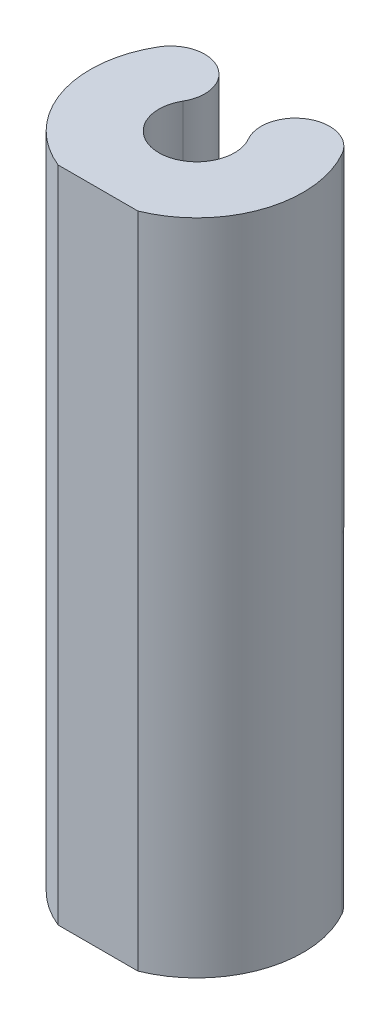
ISO-10303-21;
HEADER;
FILE_DESCRIPTION(('STEP AP214'),'2;1');
FILE_NAME('part.step','',(''),(''),'','','');
FILE_SCHEMA(('AUTOMOTIVE_DESIGN { 1 0 10303 214 1 1 1 1 }'));
ENDSEC;
DATA;
#1=APPLICATION_CONTEXT('core data for automotive mechanical design processes');
#2=APPLICATION_PROTOCOL_DEFINITION('international standard','automotive_design',2000,#1);
#3=PRODUCT_CONTEXT('',#1,'mechanical');
#4=PRODUCT('Part','Part','',(#3));
#5=PRODUCT_RELATED_PRODUCT_CATEGORY('part','',(#4));
#6=PRODUCT_DEFINITION_FORMATION('','',#4);
#7=PRODUCT_DEFINITION_CONTEXT('part definition',#1,'design');
#8=PRODUCT_DEFINITION('design','',#6,#7);
#9=PRODUCT_DEFINITION_SHAPE('','',#8);
#10=(LENGTH_UNIT() NAMED_UNIT(*) SI_UNIT(.MILLI.,.METRE.));
#11=(NAMED_UNIT(*) PLANE_ANGLE_UNIT() SI_UNIT($,.RADIAN.));
#12=(NAMED_UNIT(*) SI_UNIT($,.STERADIAN.) SOLID_ANGLE_UNIT());
#13=UNCERTAINTY_MEASURE_WITH_UNIT(LENGTH_MEASURE(1.E-05),#10,'distance_accuracy_value','');
#14=(GEOMETRIC_REPRESENTATION_CONTEXT(3) GLOBAL_UNCERTAINTY_ASSIGNED_CONTEXT((#13)) GLOBAL_UNIT_ASSIGNED_CONTEXT((#10,
#11,#12)) REPRESENTATION_CONTEXT('',''));
#15=CARTESIAN_POINT('',(0.,0.,0.));
#16=DIRECTION('',(0.,0.,1.));
#17=DIRECTION('',(1.,0.,0.));
#18=AXIS2_PLACEMENT_3D('',#15,#16,#17);
#19=CARTESIAN_POINT('',(0.,25.4,0.));
#20=DIRECTION('',(0.,-1.,0.));
#21=DIRECTION('',(0.,0.,-1.));
#22=AXIS2_PLACEMENT_3D('',#19,#20,#21);
#23=CYLINDRICAL_SURFACE('',#22,8.2169);
#24=DIRECTION('',(0.,1.,0.));
#25=VECTOR('',#24,1.);
#26=CARTESIAN_POINT('',(-3.07458055838516,0.,7.62));
#27=LINE('',#26,#25);
#28=CARTESIAN_POINT('',(-3.07458055838516,0.,7.62));
#29=VERTEX_POINT('',#28);
#30=CARTESIAN_POINT('',(-3.07458055838516,50.8,7.62));
#31=VERTEX_POINT('',#30);
#32=EDGE_CURVE('E108',#29,#31,#27,.T.);
#33=ORIENTED_EDGE('',*,*,#32,.T.);
#34=CARTESIAN_POINT('',(0.,50.8,0.));
#35=DIRECTION('',(0.,1.,0.));
#36=DIRECTION('',(0.,0.,1.));
#37=AXIS2_PLACEMENT_3D('',#34,#35,#36);
#38=CIRCLE('',#37,8.2169);
#39=CARTESIAN_POINT('',(-7.10918913480885,50.8,-4.12030040840663));
#40=VERTEX_POINT('',#39);
#41=EDGE_CURVE('E180',#40,#31,#38,.T.);
#42=ORIENTED_EDGE('',*,*,#41,.F.);
#43=DIRECTION('',(0.,-1.,0.));
#44=VECTOR('',#43,1.);
#45=CARTESIAN_POINT('',(-7.10918913480885,50.8,-4.12030040840663));
#46=LINE('',#45,#44);
#47=CARTESIAN_POINT('',(-7.10918913480885,25.4,-4.12030040840663));
#48=VERTEX_POINT('',#47);
#49=EDGE_CURVE('E160',#40,#48,#46,.T.);
#50=ORIENTED_EDGE('',*,*,#49,.T.);
#51=DIRECTION('',(0.,-1.,0.));
#52=VECTOR('',#51,1.);
#53=CARTESIAN_POINT('',(-7.10918913480885,25.4,-4.12030040840662));
#54=LINE('',#53,#52);
#55=CARTESIAN_POINT('',(-7.10918913480885,0.,-4.12030040840662));
#56=VERTEX_POINT('',#55);
#57=EDGE_CURVE('E127',#48,#56,#54,.T.);
#58=ORIENTED_EDGE('',*,*,#57,.T.);
#59=CARTESIAN_POINT('',(0.,0.,0.));
#60=DIRECTION('',(0.,1.,0.));
#61=DIRECTION('',(0.,0.,1.));
#62=AXIS2_PLACEMENT_3D('',#59,#60,#61);
#63=CIRCLE('',#62,8.2169);
#64=EDGE_CURVE('E122',#56,#29,#63,.T.);
#65=ORIENTED_EDGE('',*,*,#64,.T.);
#66=EDGE_LOOP('',(#33,#42,#50,#58,#65));
#67=FACE_BOUND('',#66,.T.);
#68=ADVANCED_FACE('F34',(#67),#23,.T.);
#69=DIRECTION('',(0.,1.,0.));
#70=VECTOR('',#69,1.);
#71=CARTESIAN_POINT('',(3.07458055838516,0.,7.62));
#72=LINE('',#71,#70);
#73=CARTESIAN_POINT('',(3.07458055838516,0.,7.62));
#74=VERTEX_POINT('',#73);
#75=CARTESIAN_POINT('',(3.07458055838516,50.8,7.62));
#76=VERTEX_POINT('',#75);
#77=EDGE_CURVE('E49',#74,#76,#72,.T.);
#78=ORIENTED_EDGE('',*,*,#77,.F.);
#79=CARTESIAN_POINT('',(7.10918913480885,0.,-4.12030040840662));
#80=VERTEX_POINT('',#79);
#81=EDGE_CURVE('E75',#74,#80,#63,.T.);
#82=ORIENTED_EDGE('',*,*,#81,.T.);
#83=DIRECTION('',(0.,-1.,0.));
#84=VECTOR('',#83,1.);
#85=CARTESIAN_POINT('',(7.10918913480885,25.4,-4.12030040840662));
#86=LINE('',#85,#84);
#87=CARTESIAN_POINT('',(7.10918913480885,25.4,-4.12030040840662));
#88=VERTEX_POINT('',#87);
#89=EDGE_CURVE('E58',#88,#80,#86,.T.);
#90=ORIENTED_EDGE('',*,*,#89,.F.);
#91=DIRECTION('',(0.,-1.,0.));
#92=VECTOR('',#91,1.);
#93=CARTESIAN_POINT('',(7.10918913480885,50.8,-4.12030040840662));
#94=LINE('',#93,#92);
#95=CARTESIAN_POINT('',(7.10918913480885,50.8,-4.12030040840662));
#96=VERTEX_POINT('',#95);
#97=EDGE_CURVE('E149',#96,#88,#94,.T.);
#98=ORIENTED_EDGE('',*,*,#97,.F.);
#99=EDGE_CURVE('E166',#76,#96,#38,.T.);
#100=ORIENTED_EDGE('',*,*,#99,.F.);
#101=EDGE_LOOP('',(#78,#82,#90,#98,#100));
#102=FACE_BOUND('',#101,.T.);
#103=ADVANCED_FACE('F187',(#102),#23,.T.);
#104=CARTESIAN_POINT('',(0.,0.,0.));
#105=DIRECTION('',(0.,1.,0.));
#106=DIRECTION('',(0.,0.,1.));
#107=AXIS2_PLACEMENT_3D('',#104,#105,#106);
#108=PLANE('',#107);
#109=DIRECTION('',(1.,0.,0.));
#110=VECTOR('',#109,1.);
#111=CARTESIAN_POINT('',(0.,0.,7.62));
#112=LINE('',#111,#110);
#113=EDGE_CURVE('E111',#29,#74,#112,.T.);
#114=ORIENTED_EDGE('',*,*,#113,.F.);
#115=ORIENTED_EDGE('',*,*,#64,.F.);
#116=CARTESIAN_POINT('',(-5.461,0.,-3.16505301851328));
#117=DIRECTION('',(0.,1.,0.));
#118=DIRECTION('',(0.,0.,1.));
#119=AXIS2_PLACEMENT_3D('',#116,#117,#118);
#120=CIRCLE('',#119,1.905);
#121=CARTESIAN_POINT('',(-3.81281086519115,0.,-2.20980562861993));
#122=VERTEX_POINT('',#121);
#123=EDGE_CURVE('E132',#122,#56,#120,.T.);
#124=ORIENTED_EDGE('',*,*,#123,.F.);
#125=CARTESIAN_POINT('',(0.,0.,0.));
#126=DIRECTION('',(0.,1.,0.));
#127=DIRECTION('',(0.,0.,1.));
#128=AXIS2_PLACEMENT_3D('',#125,#126,#127);
#129=CIRCLE('',#128,4.4069);
#130=CARTESIAN_POINT('',(3.81281086519115,0.,-2.20980562861993));
#131=VERTEX_POINT('',#130);
#132=EDGE_CURVE('E146',#122,#131,#129,.T.);
#133=ORIENTED_EDGE('',*,*,#132,.T.);
#134=CARTESIAN_POINT('',(5.461,0.,-3.16505301851328));
#135=DIRECTION('',(0.,1.,0.));
#136=DIRECTION('',(0.,0.,1.));
#137=AXIS2_PLACEMENT_3D('',#134,#135,#136);
#138=CIRCLE('',#137,1.905);
#139=EDGE_CURVE('E148',#131,#80,#138,.F.);
#140=ORIENTED_EDGE('',*,*,#139,.T.);
#141=ORIENTED_EDGE('',*,*,#81,.F.);
#142=EDGE_LOOP('',(#114,#115,#124,#133,#140,#141));
#143=FACE_BOUND('',#142,.T.);
#144=ADVANCED_FACE('F120',(#143),#108,.F.);
#145=CARTESIAN_POINT('',(0.,50.8,0.));
#146=DIRECTION('',(0.,1.,0.));
#147=DIRECTION('',(0.,0.,1.));
#148=AXIS2_PLACEMENT_3D('',#145,#146,#147);
#149=PLANE('',#148);
#150=ORIENTED_EDGE('',*,*,#41,.T.);
#151=DIRECTION('',(1.,0.,0.));
#152=VECTOR('',#151,1.);
#153=CARTESIAN_POINT('',(0.,50.8,7.62));
#154=LINE('',#153,#152);
#155=EDGE_CURVE('E112',#31,#76,#154,.T.);
#156=ORIENTED_EDGE('',*,*,#155,.T.);
#157=ORIENTED_EDGE('',*,*,#99,.T.);
#158=CARTESIAN_POINT('',(4.81820623742455,50.8,-2.79250653645487));
#159=DIRECTION('',(0.,1.,0.));
#160=DIRECTION('',(0.,0.,1.));
#161=AXIS2_PLACEMENT_3D('',#158,#159,#160);
#162=CIRCLE('',#161,2.64795);
#163=CARTESIAN_POINT('',(2.52722334004024,50.8,-1.46471266450313));
#164=VERTEX_POINT('',#163);
#165=EDGE_CURVE('E177',#164,#96,#162,.F.);
#166=ORIENTED_EDGE('',*,*,#165,.F.);
#167=CARTESIAN_POINT('',(0.,50.8,0.));
#168=DIRECTION('',(0.,1.,0.));
#169=DIRECTION('',(0.,0.,1.));
#170=AXIS2_PLACEMENT_3D('',#167,#168,#169);
#171=CIRCLE('',#170,2.921);
#172=CARTESIAN_POINT('',(-2.52722334004024,50.8,-1.46471266450313));
#173=VERTEX_POINT('',#172);
#174=EDGE_CURVE('E174',#173,#164,#171,.T.);
#175=ORIENTED_EDGE('',*,*,#174,.F.);
#176=CARTESIAN_POINT('',(-4.81820623742455,50.8,-2.79250653645487));
#177=DIRECTION('',(0.,1.,0.));
#178=DIRECTION('',(0.,0.,1.));
#179=AXIS2_PLACEMENT_3D('',#176,#177,#178);
#180=CIRCLE('',#179,2.64795);
#181=EDGE_CURVE('E162',#173,#40,#180,.T.);
#182=ORIENTED_EDGE('',*,*,#181,.T.);
#183=EDGE_LOOP('',(#150,#156,#157,#166,#175,#182));
#184=FACE_BOUND('',#183,.T.);
#185=ADVANCED_FACE('F185',(#184),#149,.T.);
#186=CARTESIAN_POINT('',(5.461,25.4,-3.16505301851328));
#187=DIRECTION('',(0.,-1.,0.));
#188=DIRECTION('',(0.,0.,-1.));
#189=AXIS2_PLACEMENT_3D('',#186,#187,#188);
#190=CYLINDRICAL_SURFACE('',#189,1.905);
#191=ORIENTED_EDGE('',*,*,#139,.F.);
#192=DIRECTION('',(0.,-1.,0.));
#193=VECTOR('',#192,1.);
#194=CARTESIAN_POINT('',(3.81281086519115,25.4,-2.20980562861993));
#195=LINE('',#194,#193);
#196=CARTESIAN_POINT('',(3.81281086519115,25.4,-2.20980562861993));
#197=VERTEX_POINT('',#196);
#198=EDGE_CURVE('E11',#197,#131,#195,.T.);
#199=ORIENTED_EDGE('',*,*,#198,.F.);
#200=CARTESIAN_POINT('',(5.461,25.4,-3.16505301851328));
#201=DIRECTION('',(0.,1.,0.));
#202=DIRECTION('',(0.,0.,1.));
#203=AXIS2_PLACEMENT_3D('',#200,#201,#202);
#204=CIRCLE('',#203,1.905);
#205=EDGE_CURVE('E128',#197,#88,#204,.F.);
#206=ORIENTED_EDGE('',*,*,#205,.T.);
#207=ORIENTED_EDGE('',*,*,#89,.T.);
#208=EDGE_LOOP('',(#191,#199,#206,#207));
#209=FACE_BOUND('',#208,.T.);
#210=ADVANCED_FACE('F36',(#209),#190,.T.);
#211=CARTESIAN_POINT('',(0.,25.4,0.));
#212=DIRECTION('',(0.,-1.,0.));
#213=DIRECTION('',(0.,0.,-1.));
#214=AXIS2_PLACEMENT_3D('',#211,#212,#213);
#215=CYLINDRICAL_SURFACE('',#214,4.4069);
#216=ORIENTED_EDGE('',*,*,#132,.F.);
#217=DIRECTION('',(0.,-1.,0.));
#218=VECTOR('',#217,1.);
#219=CARTESIAN_POINT('',(-3.81281086519115,25.4,-2.20980562861993));
#220=LINE('',#219,#218);
#221=CARTESIAN_POINT('',(-3.81281086519115,25.4,-2.20980562861993));
#222=VERTEX_POINT('',#221);
#223=EDGE_CURVE('E42',#222,#122,#220,.T.);
#224=ORIENTED_EDGE('',*,*,#223,.F.);
#225=CARTESIAN_POINT('',(0.,25.4,0.));
#226=DIRECTION('',(0.,1.,0.));
#227=DIRECTION('',(0.,0.,1.));
#228=AXIS2_PLACEMENT_3D('',#225,#226,#227);
#229=CIRCLE('',#228,4.4069);
#230=EDGE_CURVE('E130',#222,#197,#229,.T.);
#231=ORIENTED_EDGE('',*,*,#230,.T.);
#232=ORIENTED_EDGE('',*,*,#198,.T.);
#233=EDGE_LOOP('',(#216,#224,#231,#232));
#234=FACE_BOUND('',#233,.T.);
#235=ADVANCED_FACE('F147',(#234),#215,.F.);
#236=CARTESIAN_POINT('',(-5.461,25.4,-3.16505301851328));
#237=DIRECTION('',(0.,-1.,0.));
#238=DIRECTION('',(0.,0.,-1.));
#239=AXIS2_PLACEMENT_3D('',#236,#237,#238);
#240=CYLINDRICAL_SURFACE('',#239,1.905);
#241=ORIENTED_EDGE('',*,*,#123,.T.);
#242=ORIENTED_EDGE('',*,*,#57,.F.);
#243=CARTESIAN_POINT('',(-5.461,25.4,-3.16505301851328));
#244=DIRECTION('',(0.,1.,0.));
#245=DIRECTION('',(0.,0.,1.));
#246=AXIS2_PLACEMENT_3D('',#243,#244,#245);
#247=CIRCLE('',#246,1.905);
#248=EDGE_CURVE('E137',#222,#48,#247,.T.);
#249=ORIENTED_EDGE('',*,*,#248,.F.);
#250=ORIENTED_EDGE('',*,*,#223,.T.);
#251=EDGE_LOOP('',(#241,#242,#249,#250));
#252=FACE_BOUND('',#251,.T.);
#253=ADVANCED_FACE('F140',(#252),#240,.T.);
#254=CARTESIAN_POINT('',(4.81820623742455,50.8,-2.79250653645487));
#255=DIRECTION('',(0.,-1.,0.));
#256=DIRECTION('',(0.,0.,-1.));
#257=AXIS2_PLACEMENT_3D('',#254,#255,#256);
#258=CYLINDRICAL_SURFACE('',#257,2.64795);
#259=CARTESIAN_POINT('',(4.81820623742455,25.4,-2.79250653645487));
#260=DIRECTION('',(0.,1.,0.));
#261=DIRECTION('',(0.,0.,1.));
#262=AXIS2_PLACEMENT_3D('',#259,#260,#261);
#263=CIRCLE('',#262,2.64795);
#264=CARTESIAN_POINT('',(2.52722334004024,25.4,-1.46471266450313));
#265=VERTEX_POINT('',#264);
#266=EDGE_CURVE('E170',#265,#88,#263,.F.);
#267=ORIENTED_EDGE('',*,*,#266,.F.);
#268=DIRECTION('',(0.,-1.,0.));
#269=VECTOR('',#268,1.);
#270=CARTESIAN_POINT('',(2.52722334004024,50.8,-1.46471266450313));
#271=LINE('',#270,#269);
#272=EDGE_CURVE('E156',#164,#265,#271,.T.);
#273=ORIENTED_EDGE('',*,*,#272,.F.);
#274=ORIENTED_EDGE('',*,*,#165,.T.);
#275=ORIENTED_EDGE('',*,*,#97,.T.);
#276=EDGE_LOOP('',(#267,#273,#274,#275));
#277=FACE_BOUND('',#276,.T.);
#278=ADVANCED_FACE('F190',(#277),#258,.T.);
#279=CARTESIAN_POINT('',(0.,50.8,0.));
#280=DIRECTION('',(0.,-1.,0.));
#281=DIRECTION('',(0.,0.,-1.));
#282=AXIS2_PLACEMENT_3D('',#279,#280,#281);
#283=CYLINDRICAL_SURFACE('',#282,2.921);
#284=CARTESIAN_POINT('',(0.,25.4,0.));
#285=DIRECTION('',(0.,1.,0.));
#286=DIRECTION('',(0.,0.,1.));
#287=AXIS2_PLACEMENT_3D('',#284,#285,#286);
#288=CIRCLE('',#287,2.921);
#289=CARTESIAN_POINT('',(-2.52722334004024,25.4,-1.46471266450313));
#290=VERTEX_POINT('',#289);
#291=EDGE_CURVE('E167',#290,#265,#288,.T.);
#292=ORIENTED_EDGE('',*,*,#291,.F.);
#293=DIRECTION('',(0.,-1.,0.));
#294=VECTOR('',#293,1.);
#295=CARTESIAN_POINT('',(-2.52722334004024,50.8,-1.46471266450313));
#296=LINE('',#295,#294);
#297=EDGE_CURVE('E158',#173,#290,#296,.T.);
#298=ORIENTED_EDGE('',*,*,#297,.F.);
#299=ORIENTED_EDGE('',*,*,#174,.T.);
#300=ORIENTED_EDGE('',*,*,#272,.T.);
#301=EDGE_LOOP('',(#292,#298,#299,#300));
#302=FACE_BOUND('',#301,.T.);
#303=ADVANCED_FACE('F194',(#302),#283,.F.);
#304=CARTESIAN_POINT('',(-4.81820623742455,50.8,-2.79250653645487));
#305=DIRECTION('',(0.,-1.,0.));
#306=DIRECTION('',(0.,0.,-1.));
#307=AXIS2_PLACEMENT_3D('',#304,#305,#306);
#308=CYLINDRICAL_SURFACE('',#307,2.64795);
#309=CARTESIAN_POINT('',(-4.81820623742455,25.4,-2.79250653645487));
#310=DIRECTION('',(0.,1.,0.));
#311=DIRECTION('',(0.,0.,1.));
#312=AXIS2_PLACEMENT_3D('',#309,#310,#311);
#313=CIRCLE('',#312,2.64795);
#314=EDGE_CURVE('E163',#290,#48,#313,.T.);
#315=ORIENTED_EDGE('',*,*,#314,.T.);
#316=ORIENTED_EDGE('',*,*,#49,.F.);
#317=ORIENTED_EDGE('',*,*,#181,.F.);
#318=ORIENTED_EDGE('',*,*,#297,.T.);
#319=EDGE_LOOP('',(#315,#316,#317,#318));
#320=FACE_BOUND('',#319,.T.);
#321=ADVANCED_FACE('F199',(#320),#308,.T.);
#322=CARTESIAN_POINT('',(0.,25.4,0.));
#323=DIRECTION('',(0.,1.,0.));
#324=DIRECTION('',(0.,0.,1.));
#325=AXIS2_PLACEMENT_3D('',#322,#323,#324);
#326=PLANE('',#325);
#327=ORIENTED_EDGE('',*,*,#205,.F.);
#328=ORIENTED_EDGE('',*,*,#230,.F.);
#329=ORIENTED_EDGE('',*,*,#248,.T.);
#330=ORIENTED_EDGE('',*,*,#314,.F.);
#331=ORIENTED_EDGE('',*,*,#291,.T.);
#332=ORIENTED_EDGE('',*,*,#266,.T.);
#333=EDGE_LOOP('',(#327,#328,#329,#330,#331,#332));
#334=FACE_BOUND('',#333,.T.);
#335=ADVANCED_FACE('F202',(#334),#326,.F.);
#336=CARTESIAN_POINT('',(0.,0.,7.62));
#337=DIRECTION('',(0.,0.,1.));
#338=DIRECTION('',(1.,0.,0.));
#339=AXIS2_PLACEMENT_3D('',#336,#337,#338);
#340=PLANE('',#339);
#341=ORIENTED_EDGE('',*,*,#155,.F.);
#342=ORIENTED_EDGE('',*,*,#32,.F.);
#343=ORIENTED_EDGE('',*,*,#113,.T.);
#344=ORIENTED_EDGE('',*,*,#77,.T.);
#345=EDGE_LOOP('',(#341,#342,#343,#344));
#346=FACE_BOUND('',#345,.T.);
#347=ADVANCED_FACE('F110',(#346),#340,.T.);
#348=CLOSED_SHELL('',(#68,#103,#144,#185,#210,#235,#253,#278,#303,#321,#335,#347));
#349=MANIFOLD_SOLID_BREP('B2',#348);
#350=ADVANCED_BREP_SHAPE_REPRESENTATION('',(#18,#349),#14);
#351=SHAPE_DEFINITION_REPRESENTATION(#9,#350);
ENDSEC;
END-ISO-10303-21;
